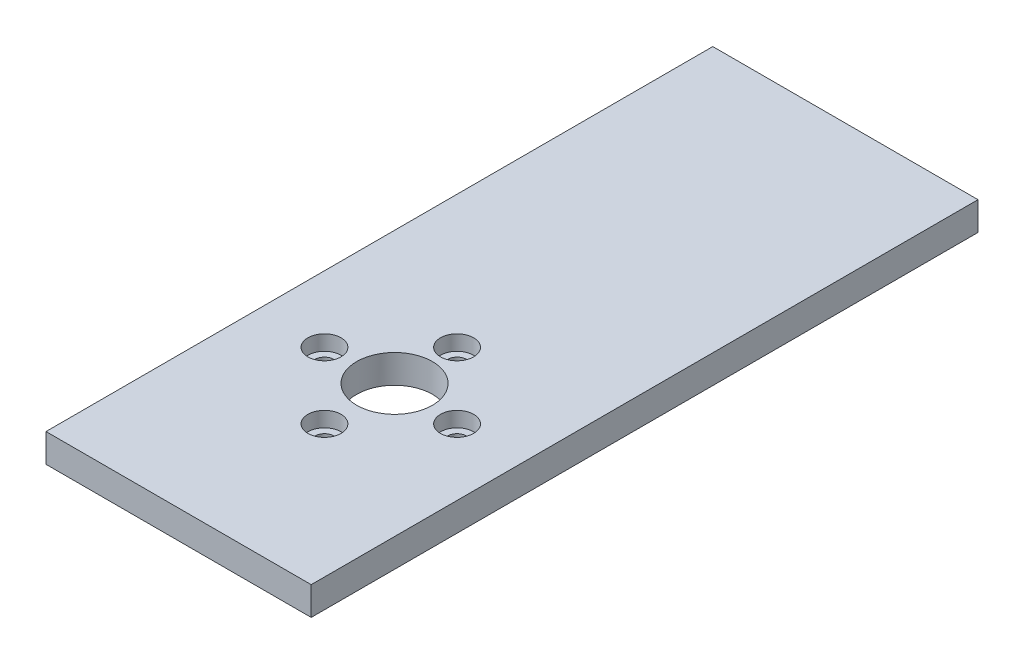
ISO-10303-21;
HEADER;
FILE_DESCRIPTION(('STEP AP214'),'2;1');
FILE_NAME('part.step','',(''),(''),'','','');
FILE_SCHEMA(('AUTOMOTIVE_DESIGN { 1 0 10303 214 1 1 1 1 }'));
ENDSEC;
DATA;
#1=APPLICATION_CONTEXT('core data for automotive mechanical design processes');
#2=APPLICATION_PROTOCOL_DEFINITION('international standard','automotive_design',2000,#1);
#3=PRODUCT_CONTEXT('',#1,'mechanical');
#4=PRODUCT('Part','Part','',(#3));
#5=PRODUCT_RELATED_PRODUCT_CATEGORY('part','',(#4));
#6=PRODUCT_DEFINITION_FORMATION('','',#4);
#7=PRODUCT_DEFINITION_CONTEXT('part definition',#1,'design');
#8=PRODUCT_DEFINITION('design','',#6,#7);
#9=PRODUCT_DEFINITION_SHAPE('','',#8);
#10=(LENGTH_UNIT() NAMED_UNIT(*) SI_UNIT(.MILLI.,.METRE.));
#11=(NAMED_UNIT(*) PLANE_ANGLE_UNIT() SI_UNIT($,.RADIAN.));
#12=(NAMED_UNIT(*) SI_UNIT($,.STERADIAN.) SOLID_ANGLE_UNIT());
#13=UNCERTAINTY_MEASURE_WITH_UNIT(LENGTH_MEASURE(1.E-05),#10,'distance_accuracy_value','');
#14=(GEOMETRIC_REPRESENTATION_CONTEXT(3) GLOBAL_UNCERTAINTY_ASSIGNED_CONTEXT((#13)) GLOBAL_UNIT_ASSIGNED_CONTEXT((#10,
#11,#12)) REPRESENTATION_CONTEXT('',''));
#15=CARTESIAN_POINT('',(0.,0.,0.));
#16=DIRECTION('',(0.,0.,1.));
#17=DIRECTION('',(1.,0.,0.));
#18=AXIS2_PLACEMENT_3D('',#15,#16,#17);
#19=CARTESIAN_POINT('',(7.0000000000001,-7.,12.7999999999978));
#20=DIRECTION('',(0.,1.,0.));
#21=DIRECTION('',(0.,0.,1.));
#22=AXIS2_PLACEMENT_3D('',#19,#20,#21);
#23=CYLINDRICAL_SURFACE('',#22,1.);
#24=CARTESIAN_POINT('',(7.0000000000001,0.,12.7999999999978));
#25=DIRECTION('',(0.,-1.,0.));
#26=DIRECTION('',(0.,0.,-1.));
#27=AXIS2_PLACEMENT_3D('',#24,#25,#26);
#28=CIRCLE('',#27,1.);
#29=CARTESIAN_POINT('',(7.0000000000001,0.,11.7999999999978));
#30=VERTEX_POINT('',#29);
#31=EDGE_CURVE('E116',#30,#30,#28,.T.);
#32=ORIENTED_EDGE('',*,*,#31,.T.);
#33=EDGE_LOOP('',(#32));
#34=FACE_BOUND('',#33,.T.);
#35=CARTESIAN_POINT('',(7.0000000000001,1.4,12.7999999999978));
#36=DIRECTION('',(0.,1.,0.));
#37=DIRECTION('',(0.,0.,1.));
#38=AXIS2_PLACEMENT_3D('',#35,#36,#37);
#39=CIRCLE('',#38,1.);
#40=CARTESIAN_POINT('',(7.0000000000001,1.4,13.7999999999978));
#41=VERTEX_POINT('',#40);
#42=EDGE_CURVE('E42',#41,#41,#39,.F.);
#43=ORIENTED_EDGE('',*,*,#42,.F.);
#44=EDGE_LOOP('',(#43));
#45=FACE_BOUND('',#44,.T.);
#46=ADVANCED_FACE('F38',(#34,#45),#23,.F.);
#47=CARTESIAN_POINT('',(-6.9999999999999,-7.,12.7999999999979));
#48=DIRECTION('',(0.,1.,0.));
#49=DIRECTION('',(0.,0.,1.));
#50=AXIS2_PLACEMENT_3D('',#47,#48,#49);
#51=CYLINDRICAL_SURFACE('',#50,1.);
#52=CARTESIAN_POINT('',(-6.9999999999999,0.,12.7999999999979));
#53=DIRECTION('',(0.,-1.,0.));
#54=DIRECTION('',(0.,0.,-1.));
#55=AXIS2_PLACEMENT_3D('',#52,#53,#54);
#56=CIRCLE('',#55,1.);
#57=CARTESIAN_POINT('',(-6.9999999999999,0.,11.7999999999979));
#58=VERTEX_POINT('',#57);
#59=EDGE_CURVE('E122',#58,#58,#56,.T.);
#60=ORIENTED_EDGE('',*,*,#59,.T.);
#61=EDGE_LOOP('',(#60));
#62=FACE_BOUND('',#61,.T.);
#63=CARTESIAN_POINT('',(-6.9999999999999,1.4,12.7999999999979));
#64=DIRECTION('',(0.,1.,0.));
#65=DIRECTION('',(0.,0.,1.));
#66=AXIS2_PLACEMENT_3D('',#63,#64,#65);
#67=CIRCLE('',#66,1.);
#68=CARTESIAN_POINT('',(-6.9999999999999,1.4,13.7999999999979));
#69=VERTEX_POINT('',#68);
#70=EDGE_CURVE('E137',#69,#69,#67,.F.);
#71=ORIENTED_EDGE('',*,*,#70,.F.);
#72=EDGE_LOOP('',(#71));
#73=FACE_BOUND('',#72,.T.);
#74=ADVANCED_FACE('F183',(#62,#73),#51,.F.);
#75=CARTESIAN_POINT('',(0.,-7.,5.79999999999792));
#76=DIRECTION('',(0.,1.,0.));
#77=DIRECTION('',(0.,0.,1.));
#78=AXIS2_PLACEMENT_3D('',#75,#76,#77);
#79=CYLINDRICAL_SURFACE('',#78,1.);
#80=CARTESIAN_POINT('',(0.,0.,5.79999999999792));
#81=DIRECTION('',(0.,-1.,0.));
#82=DIRECTION('',(0.,0.,-1.));
#83=AXIS2_PLACEMENT_3D('',#80,#81,#82);
#84=CIRCLE('',#83,1.);
#85=CARTESIAN_POINT('',(0.,0.,4.79999999999792));
#86=VERTEX_POINT('',#85);
#87=EDGE_CURVE('E108',#86,#86,#84,.T.);
#88=ORIENTED_EDGE('',*,*,#87,.T.);
#89=EDGE_LOOP('',(#88));
#90=FACE_BOUND('',#89,.T.);
#91=CARTESIAN_POINT('',(0.,1.4,5.79999999999792));
#92=DIRECTION('',(0.,1.,0.));
#93=DIRECTION('',(0.,0.,1.));
#94=AXIS2_PLACEMENT_3D('',#91,#92,#93);
#95=CIRCLE('',#94,1.);
#96=CARTESIAN_POINT('',(0.,1.4,6.79999999999792));
#97=VERTEX_POINT('',#96);
#98=EDGE_CURVE('E133',#97,#97,#95,.F.);
#99=ORIENTED_EDGE('',*,*,#98,.F.);
#100=EDGE_LOOP('',(#99));
#101=FACE_BOUND('',#100,.T.);
#102=ADVANCED_FACE('F189',(#90,#101),#79,.F.);
#103=CARTESIAN_POINT('',(1.45764745514838E-13,-7.,19.7999999999979));
#104=DIRECTION('',(0.,1.,0.));
#105=DIRECTION('',(0.,0.,1.));
#106=AXIS2_PLACEMENT_3D('',#103,#104,#105);
#107=CYLINDRICAL_SURFACE('',#106,1.);
#108=CARTESIAN_POINT('',(1.45764745514838E-13,0.,19.7999999999979));
#109=DIRECTION('',(0.,-1.,0.));
#110=DIRECTION('',(0.,0.,-1.));
#111=AXIS2_PLACEMENT_3D('',#108,#109,#110);
#112=CIRCLE('',#111,1.);
#113=CARTESIAN_POINT('',(1.45764745514838E-13,0.,18.7999999999979));
#114=VERTEX_POINT('',#113);
#115=EDGE_CURVE('E119',#114,#114,#112,.T.);
#116=ORIENTED_EDGE('',*,*,#115,.T.);
#117=EDGE_LOOP('',(#116));
#118=FACE_BOUND('',#117,.T.);
#119=CARTESIAN_POINT('',(1.45764745514838E-13,1.4,19.7999999999979));
#120=DIRECTION('',(0.,1.,0.));
#121=DIRECTION('',(0.,0.,1.));
#122=AXIS2_PLACEMENT_3D('',#119,#120,#121);
#123=CIRCLE('',#122,1.);
#124=CARTESIAN_POINT('',(1.45764745514838E-13,1.4,20.7999999999979));
#125=VERTEX_POINT('',#124);
#126=EDGE_CURVE('E129',#125,#125,#123,.F.);
#127=ORIENTED_EDGE('',*,*,#126,.F.);
#128=EDGE_LOOP('',(#127));
#129=FACE_BOUND('',#128,.T.);
#130=ADVANCED_FACE('F194',(#118,#129),#107,.F.);
#131=CARTESIAN_POINT('',(14.,3.,35.2));
#132=DIRECTION('',(-1.,0.,0.));
#133=DIRECTION('',(0.,0.,1.));
#134=AXIS2_PLACEMENT_3D('',#131,#132,#133);
#135=PLANE('',#134);
#136=DIRECTION('',(0.,0.,-1.));
#137=VECTOR('',#136,1.);
#138=CARTESIAN_POINT('',(14.,0.,35.2));
#139=LINE('',#138,#137);
#140=CARTESIAN_POINT('',(14.,0.,35.2));
#141=VERTEX_POINT('',#140);
#142=CARTESIAN_POINT('',(14.,0.,-35.2));
#143=VERTEX_POINT('',#142);
#144=EDGE_CURVE('E105',#141,#143,#139,.T.);
#145=ORIENTED_EDGE('',*,*,#144,.T.);
#146=DIRECTION('',(0.,-1.,0.));
#147=VECTOR('',#146,1.);
#148=CARTESIAN_POINT('',(14.,3.,-35.2));
#149=LINE('',#148,#147);
#150=CARTESIAN_POINT('',(14.,3.,-35.2));
#151=VERTEX_POINT('',#150);
#152=EDGE_CURVE('E11',#151,#143,#149,.T.);
#153=ORIENTED_EDGE('',*,*,#152,.F.);
#154=DIRECTION('',(0.,0.,-1.));
#155=VECTOR('',#154,1.);
#156=CARTESIAN_POINT('',(14.,3.,35.2));
#157=LINE('',#156,#155);
#158=CARTESIAN_POINT('',(14.,3.,35.2));
#159=VERTEX_POINT('',#158);
#160=EDGE_CURVE('E92',#159,#151,#157,.T.);
#161=ORIENTED_EDGE('',*,*,#160,.F.);
#162=DIRECTION('',(0.,-1.,0.));
#163=VECTOR('',#162,1.);
#164=CARTESIAN_POINT('',(14.,3.,35.2));
#165=LINE('',#164,#163);
#166=EDGE_CURVE('E101',#159,#141,#165,.T.);
#167=ORIENTED_EDGE('',*,*,#166,.T.);
#168=EDGE_LOOP('',(#145,#153,#161,#167));
#169=FACE_BOUND('',#168,.T.);
#170=ADVANCED_FACE('F40',(#169),#135,.F.);
#171=CARTESIAN_POINT('',(-14.,3.,-35.2));
#172=DIRECTION('',(0.,0.,1.));
#173=DIRECTION('',(1.,0.,0.));
#174=AXIS2_PLACEMENT_3D('',#171,#172,#173);
#175=PLANE('',#174);
#176=DIRECTION('',(-1.,0.,0.));
#177=VECTOR('',#176,1.);
#178=CARTESIAN_POINT('',(-14.,0.,-35.2));
#179=LINE('',#178,#177);
#180=CARTESIAN_POINT('',(-14.,0.,-35.2));
#181=VERTEX_POINT('',#180);
#182=EDGE_CURVE('E96',#143,#181,#179,.T.);
#183=ORIENTED_EDGE('',*,*,#182,.T.);
#184=DIRECTION('',(0.,-1.,0.));
#185=VECTOR('',#184,1.);
#186=CARTESIAN_POINT('',(-14.,3.,-35.2));
#187=LINE('',#186,#185);
#188=CARTESIAN_POINT('',(-14.,3.,-35.2));
#189=VERTEX_POINT('',#188);
#190=EDGE_CURVE('E48',#189,#181,#187,.T.);
#191=ORIENTED_EDGE('',*,*,#190,.F.);
#192=DIRECTION('',(-1.,0.,0.));
#193=VECTOR('',#192,1.);
#194=CARTESIAN_POINT('',(-14.,3.,-35.2));
#195=LINE('',#194,#193);
#196=EDGE_CURVE('E87',#151,#189,#195,.T.);
#197=ORIENTED_EDGE('',*,*,#196,.F.);
#198=ORIENTED_EDGE('',*,*,#152,.T.);
#199=EDGE_LOOP('',(#183,#191,#197,#198));
#200=FACE_BOUND('',#199,.T.);
#201=ADVANCED_FACE('F95',(#200),#175,.F.);
#202=CARTESIAN_POINT('',(-14.,3.,35.2));
#203=DIRECTION('',(1.,0.,0.));
#204=DIRECTION('',(0.,0.,-1.));
#205=AXIS2_PLACEMENT_3D('',#202,#203,#204);
#206=PLANE('',#205);
#207=DIRECTION('',(0.,0.,1.));
#208=VECTOR('',#207,1.);
#209=CARTESIAN_POINT('',(-14.,0.,35.2));
#210=LINE('',#209,#208);
#211=CARTESIAN_POINT('',(-14.,0.,35.2));
#212=VERTEX_POINT('',#211);
#213=EDGE_CURVE('E74',#181,#212,#210,.T.);
#214=ORIENTED_EDGE('',*,*,#213,.T.);
#215=DIRECTION('',(0.,-1.,0.));
#216=VECTOR('',#215,1.);
#217=CARTESIAN_POINT('',(-14.,3.,35.2));
#218=LINE('',#217,#216);
#219=CARTESIAN_POINT('',(-14.,3.,35.2));
#220=VERTEX_POINT('',#219);
#221=EDGE_CURVE('E97',#220,#212,#218,.T.);
#222=ORIENTED_EDGE('',*,*,#221,.F.);
#223=DIRECTION('',(0.,0.,1.));
#224=VECTOR('',#223,1.);
#225=CARTESIAN_POINT('',(-14.,3.,35.2));
#226=LINE('',#225,#224);
#227=EDGE_CURVE('E90',#189,#220,#226,.T.);
#228=ORIENTED_EDGE('',*,*,#227,.F.);
#229=ORIENTED_EDGE('',*,*,#190,.T.);
#230=EDGE_LOOP('',(#214,#222,#228,#229));
#231=FACE_BOUND('',#230,.T.);
#232=ADVANCED_FACE('F99',(#231),#206,.F.);
#233=CARTESIAN_POINT('',(-14.,3.,35.2));
#234=DIRECTION('',(0.,0.,-1.));
#235=DIRECTION('',(-1.,0.,0.));
#236=AXIS2_PLACEMENT_3D('',#233,#234,#235);
#237=PLANE('',#236);
#238=DIRECTION('',(1.,0.,0.));
#239=VECTOR('',#238,1.);
#240=CARTESIAN_POINT('',(-14.,0.,35.2));
#241=LINE('',#240,#239);
#242=EDGE_CURVE('E80',#212,#141,#241,.T.);
#243=ORIENTED_EDGE('',*,*,#242,.T.);
#244=ORIENTED_EDGE('',*,*,#166,.F.);
#245=DIRECTION('',(1.,0.,0.));
#246=VECTOR('',#245,1.);
#247=CARTESIAN_POINT('',(-14.,3.,35.2));
#248=LINE('',#247,#246);
#249=EDGE_CURVE('E57',#220,#159,#248,.T.);
#250=ORIENTED_EDGE('',*,*,#249,.F.);
#251=ORIENTED_EDGE('',*,*,#221,.T.);
#252=EDGE_LOOP('',(#243,#244,#250,#251));
#253=FACE_BOUND('',#252,.T.);
#254=ADVANCED_FACE('F169',(#253),#237,.F.);
#255=CARTESIAN_POINT('',(0.,3.,0.));
#256=DIRECTION('',(0.,-1.,0.));
#257=DIRECTION('',(0.,0.,-1.));
#258=AXIS2_PLACEMENT_3D('',#255,#256,#257);
#259=PLANE('',#258);
#260=CARTESIAN_POINT('',(7.0000000000001,3.,12.7999999999978));
#261=DIRECTION('',(0.,1.,0.));
#262=DIRECTION('',(0.,0.,1.));
#263=AXIS2_PLACEMENT_3D('',#260,#261,#262);
#264=CIRCLE('',#263,1.75);
#265=CARTESIAN_POINT('',(7.0000000000001,3.,14.5499999999978));
#266=VERTEX_POINT('',#265);
#267=EDGE_CURVE('E153',#266,#266,#264,.T.);
#268=ORIENTED_EDGE('',*,*,#267,.F.);
#269=EDGE_LOOP('',(#268));
#270=FACE_BOUND('',#269,.T.);
#271=CARTESIAN_POINT('',(-6.9999999999999,3.,12.7999999999979));
#272=DIRECTION('',(0.,1.,0.));
#273=DIRECTION('',(0.,0.,1.));
#274=AXIS2_PLACEMENT_3D('',#271,#272,#273);
#275=CIRCLE('',#274,1.75);
#276=CARTESIAN_POINT('',(-6.9999999999999,3.,14.5499999999979));
#277=VERTEX_POINT('',#276);
#278=EDGE_CURVE('E146',#277,#277,#275,.T.);
#279=ORIENTED_EDGE('',*,*,#278,.F.);
#280=EDGE_LOOP('',(#279));
#281=FACE_BOUND('',#280,.T.);
#282=CARTESIAN_POINT('',(0.,3.,5.79999999999792));
#283=DIRECTION('',(0.,1.,0.));
#284=DIRECTION('',(0.,0.,1.));
#285=AXIS2_PLACEMENT_3D('',#282,#283,#284);
#286=CIRCLE('',#285,1.75);
#287=CARTESIAN_POINT('',(0.,3.,7.54999999999792));
#288=VERTEX_POINT('',#287);
#289=EDGE_CURVE('E139',#288,#288,#286,.T.);
#290=ORIENTED_EDGE('',*,*,#289,.F.);
#291=EDGE_LOOP('',(#290));
#292=FACE_BOUND('',#291,.T.);
#293=CARTESIAN_POINT('',(1.45764745514838E-13,3.,19.7999999999979));
#294=DIRECTION('',(0.,1.,0.));
#295=DIRECTION('',(0.,0.,1.));
#296=AXIS2_PLACEMENT_3D('',#293,#294,#295);
#297=CIRCLE('',#296,1.75);
#298=CARTESIAN_POINT('',(1.45764745514838E-13,3.,21.5499999999979));
#299=VERTEX_POINT('',#298);
#300=EDGE_CURVE('E135',#299,#299,#297,.T.);
#301=ORIENTED_EDGE('',*,*,#300,.F.);
#302=EDGE_LOOP('',(#301));
#303=FACE_BOUND('',#302,.T.);
#304=CARTESIAN_POINT('',(0.,3.,12.3999999999985));
#305=DIRECTION('',(0.,1.,0.));
#306=DIRECTION('',(0.,0.,1.));
#307=AXIS2_PLACEMENT_3D('',#304,#305,#306);
#308=CIRCLE('',#307,4.);
#309=CARTESIAN_POINT('',(0.,3.,16.3999999999985));
#310=VERTEX_POINT('',#309);
#311=EDGE_CURVE('E128',#310,#310,#308,.T.);
#312=ORIENTED_EDGE('',*,*,#311,.F.);
#313=EDGE_LOOP('',(#312));
#314=FACE_BOUND('',#313,.T.);
#315=ORIENTED_EDGE('',*,*,#160,.T.);
#316=ORIENTED_EDGE('',*,*,#196,.T.);
#317=ORIENTED_EDGE('',*,*,#227,.T.);
#318=ORIENTED_EDGE('',*,*,#249,.T.);
#319=EDGE_LOOP('',(#315,#316,#317,#318));
#320=FACE_BOUND('',#319,.T.);
#321=ADVANCED_FACE('F88',(#270,#281,#292,#303,#314,#320),#259,.F.);
#322=CARTESIAN_POINT('',(0.,0.,0.));
#323=DIRECTION('',(0.,-1.,0.));
#324=DIRECTION('',(0.,0.,-1.));
#325=AXIS2_PLACEMENT_3D('',#322,#323,#324);
#326=PLANE('',#325);
#327=CARTESIAN_POINT('',(0.,0.,12.3999999999985));
#328=DIRECTION('',(0.,-1.,0.));
#329=DIRECTION('',(0.,0.,-1.));
#330=AXIS2_PLACEMENT_3D('',#327,#328,#329);
#331=CIRCLE('',#330,4.);
#332=CARTESIAN_POINT('',(0.,0.,8.39999999999852));
#333=VERTEX_POINT('',#332);
#334=EDGE_CURVE('E125',#333,#333,#331,.T.);
#335=ORIENTED_EDGE('',*,*,#334,.F.);
#336=EDGE_LOOP('',(#335));
#337=FACE_BOUND('',#336,.T.);
#338=ORIENTED_EDGE('',*,*,#59,.F.);
#339=EDGE_LOOP('',(#338));
#340=FACE_BOUND('',#339,.T.);
#341=ORIENTED_EDGE('',*,*,#115,.F.);
#342=EDGE_LOOP('',(#341));
#343=FACE_BOUND('',#342,.T.);
#344=ORIENTED_EDGE('',*,*,#31,.F.);
#345=EDGE_LOOP('',(#344));
#346=FACE_BOUND('',#345,.T.);
#347=ORIENTED_EDGE('',*,*,#87,.F.);
#348=EDGE_LOOP('',(#347));
#349=FACE_BOUND('',#348,.T.);
#350=ORIENTED_EDGE('',*,*,#144,.F.);
#351=ORIENTED_EDGE('',*,*,#242,.F.);
#352=ORIENTED_EDGE('',*,*,#213,.F.);
#353=ORIENTED_EDGE('',*,*,#182,.F.);
#354=EDGE_LOOP('',(#350,#351,#352,#353));
#355=FACE_BOUND('',#354,.T.);
#356=ADVANCED_FACE('F168',(#337,#340,#343,#346,#349,#355),#326,.T.);
#357=CARTESIAN_POINT('',(0.,-7.,12.3999999999985));
#358=DIRECTION('',(0.,1.,0.));
#359=DIRECTION('',(0.,0.,1.));
#360=AXIS2_PLACEMENT_3D('',#357,#358,#359);
#361=CYLINDRICAL_SURFACE('',#360,4.);
#362=ORIENTED_EDGE('',*,*,#334,.T.);
#363=EDGE_LOOP('',(#362));
#364=FACE_BOUND('',#363,.T.);
#365=ORIENTED_EDGE('',*,*,#311,.T.);
#366=EDGE_LOOP('',(#365));
#367=FACE_BOUND('',#366,.T.);
#368=ADVANCED_FACE('F165',(#364,#367),#361,.F.);
#369=CARTESIAN_POINT('',(1.45764745514838E-13,1.4,19.7999999999979));
#370=DIRECTION('',(0.,1.,0.));
#371=DIRECTION('',(0.,0.,1.));
#372=AXIS2_PLACEMENT_3D('',#369,#370,#371);
#373=PLANE('',#372);
#374=CARTESIAN_POINT('',(1.45764745514838E-13,1.4,19.7999999999979));
#375=DIRECTION('',(0.,1.,0.));
#376=DIRECTION('',(0.,0.,1.));
#377=AXIS2_PLACEMENT_3D('',#374,#375,#376);
#378=CIRCLE('',#377,1.75);
#379=CARTESIAN_POINT('',(1.45764745514838E-13,1.4,21.5499999999979));
#380=VERTEX_POINT('',#379);
#381=EDGE_CURVE('E132',#380,#380,#378,.T.);
#382=ORIENTED_EDGE('',*,*,#381,.T.);
#383=EDGE_LOOP('',(#382));
#384=FACE_BOUND('',#383,.T.);
#385=ORIENTED_EDGE('',*,*,#126,.T.);
#386=EDGE_LOOP('',(#385));
#387=FACE_BOUND('',#386,.T.);
#388=ADVANCED_FACE('F218',(#384,#387),#373,.T.);
#389=CARTESIAN_POINT('',(1.45764745514838E-13,1.4,19.7999999999979));
#390=DIRECTION('',(0.,1.,0.));
#391=DIRECTION('',(0.,0.,1.));
#392=AXIS2_PLACEMENT_3D('',#389,#390,#391);
#393=CYLINDRICAL_SURFACE('',#392,1.75);
#394=ORIENTED_EDGE('',*,*,#381,.F.);
#395=EDGE_LOOP('',(#394));
#396=FACE_BOUND('',#395,.T.);
#397=ORIENTED_EDGE('',*,*,#300,.T.);
#398=EDGE_LOOP('',(#397));
#399=FACE_BOUND('',#398,.T.);
#400=ADVANCED_FACE('F208',(#396,#399),#393,.F.);
#401=CARTESIAN_POINT('',(0.,1.4,5.79999999999792));
#402=DIRECTION('',(0.,1.,0.));
#403=DIRECTION('',(0.,0.,1.));
#404=AXIS2_PLACEMENT_3D('',#401,#402,#403);
#405=PLANE('',#404);
#406=CARTESIAN_POINT('',(0.,1.4,5.79999999999792));
#407=DIRECTION('',(0.,1.,0.));
#408=DIRECTION('',(0.,0.,1.));
#409=AXIS2_PLACEMENT_3D('',#406,#407,#408);
#410=CIRCLE('',#409,1.75);
#411=CARTESIAN_POINT('',(0.,1.4,7.54999999999792));
#412=VERTEX_POINT('',#411);
#413=EDGE_CURVE('E136',#412,#412,#410,.T.);
#414=ORIENTED_EDGE('',*,*,#413,.T.);
#415=EDGE_LOOP('',(#414));
#416=FACE_BOUND('',#415,.T.);
#417=ORIENTED_EDGE('',*,*,#98,.T.);
#418=EDGE_LOOP('',(#417));
#419=FACE_BOUND('',#418,.T.);
#420=ADVANCED_FACE('F205',(#416,#419),#405,.T.);
#421=CARTESIAN_POINT('',(0.,1.4,5.79999999999792));
#422=DIRECTION('',(0.,1.,0.));
#423=DIRECTION('',(0.,0.,1.));
#424=AXIS2_PLACEMENT_3D('',#421,#422,#423);
#425=CYLINDRICAL_SURFACE('',#424,1.75);
#426=ORIENTED_EDGE('',*,*,#413,.F.);
#427=EDGE_LOOP('',(#426));
#428=FACE_BOUND('',#427,.T.);
#429=ORIENTED_EDGE('',*,*,#289,.T.);
#430=EDGE_LOOP('',(#429));
#431=FACE_BOUND('',#430,.T.);
#432=ADVANCED_FACE('F207',(#428,#431),#425,.F.);
#433=CARTESIAN_POINT('',(-6.9999999999999,1.4,12.7999999999979));
#434=DIRECTION('',(0.,1.,0.));
#435=DIRECTION('',(0.,0.,1.));
#436=AXIS2_PLACEMENT_3D('',#433,#434,#435);
#437=PLANE('',#436);
#438=CARTESIAN_POINT('',(-6.9999999999999,1.4,12.7999999999979));
#439=DIRECTION('',(0.,1.,0.));
#440=DIRECTION('',(0.,0.,1.));
#441=AXIS2_PLACEMENT_3D('',#438,#439,#440);
#442=CIRCLE('',#441,1.75);
#443=CARTESIAN_POINT('',(-6.9999999999999,1.4,14.5499999999979));
#444=VERTEX_POINT('',#443);
#445=EDGE_CURVE('E140',#444,#444,#442,.T.);
#446=ORIENTED_EDGE('',*,*,#445,.T.);
#447=EDGE_LOOP('',(#446));
#448=FACE_BOUND('',#447,.T.);
#449=ORIENTED_EDGE('',*,*,#70,.T.);
#450=EDGE_LOOP('',(#449));
#451=FACE_BOUND('',#450,.T.);
#452=ADVANCED_FACE('F215',(#448,#451),#437,.T.);
#453=CARTESIAN_POINT('',(-6.9999999999999,1.4,12.7999999999979));
#454=DIRECTION('',(0.,1.,0.));
#455=DIRECTION('',(0.,0.,1.));
#456=AXIS2_PLACEMENT_3D('',#453,#454,#455);
#457=CYLINDRICAL_SURFACE('',#456,1.75);
#458=ORIENTED_EDGE('',*,*,#445,.F.);
#459=EDGE_LOOP('',(#458));
#460=FACE_BOUND('',#459,.T.);
#461=ORIENTED_EDGE('',*,*,#278,.T.);
#462=EDGE_LOOP('',(#461));
#463=FACE_BOUND('',#462,.T.);
#464=ADVANCED_FACE('F222',(#460,#463),#457,.F.);
#465=CARTESIAN_POINT('',(7.0000000000001,1.4,12.7999999999978));
#466=DIRECTION('',(0.,1.,0.));
#467=DIRECTION('',(0.,0.,1.));
#468=AXIS2_PLACEMENT_3D('',#465,#466,#467);
#469=PLANE('',#468);
#470=CARTESIAN_POINT('',(7.0000000000001,1.4,12.7999999999978));
#471=DIRECTION('',(0.,1.,0.));
#472=DIRECTION('',(0.,0.,1.));
#473=AXIS2_PLACEMENT_3D('',#470,#471,#472);
#474=CIRCLE('',#473,1.75);
#475=CARTESIAN_POINT('',(7.0000000000001,1.4,14.5499999999978));
#476=VERTEX_POINT('',#475);
#477=EDGE_CURVE('E355',#476,#476,#474,.T.);
#478=ORIENTED_EDGE('',*,*,#477,.T.);
#479=EDGE_LOOP('',(#478));
#480=FACE_BOUND('',#479,.T.);
#481=ORIENTED_EDGE('',*,*,#42,.T.);
#482=EDGE_LOOP('',(#481));
#483=FACE_BOUND('',#482,.T.);
#484=ADVANCED_FACE('F329',(#480,#483),#469,.T.);
#485=CARTESIAN_POINT('',(7.0000000000001,1.4,12.7999999999978));
#486=DIRECTION('',(0.,1.,0.));
#487=DIRECTION('',(0.,0.,1.));
#488=AXIS2_PLACEMENT_3D('',#485,#486,#487);
#489=CYLINDRICAL_SURFACE('',#488,1.75);
#490=ORIENTED_EDGE('',*,*,#477,.F.);
#491=EDGE_LOOP('',(#490));
#492=FACE_BOUND('',#491,.T.);
#493=ORIENTED_EDGE('',*,*,#267,.T.);
#494=EDGE_LOOP('',(#493));
#495=FACE_BOUND('',#494,.T.);
#496=ADVANCED_FACE('F338',(#492,#495),#489,.F.);
#497=CLOSED_SHELL('',(#46,#74,#102,#130,#170,#201,#232,#254,#321,#356,#368,#388,#400,#420,#432,
#452,#464,#484,#496));
#498=MANIFOLD_SOLID_BREP('B2',#497);
#499=ADVANCED_BREP_SHAPE_REPRESENTATION('',(#18,#498),#14);
#500=SHAPE_DEFINITION_REPRESENTATION(#9,#499);
ENDSEC;
END-ISO-10303-21;
